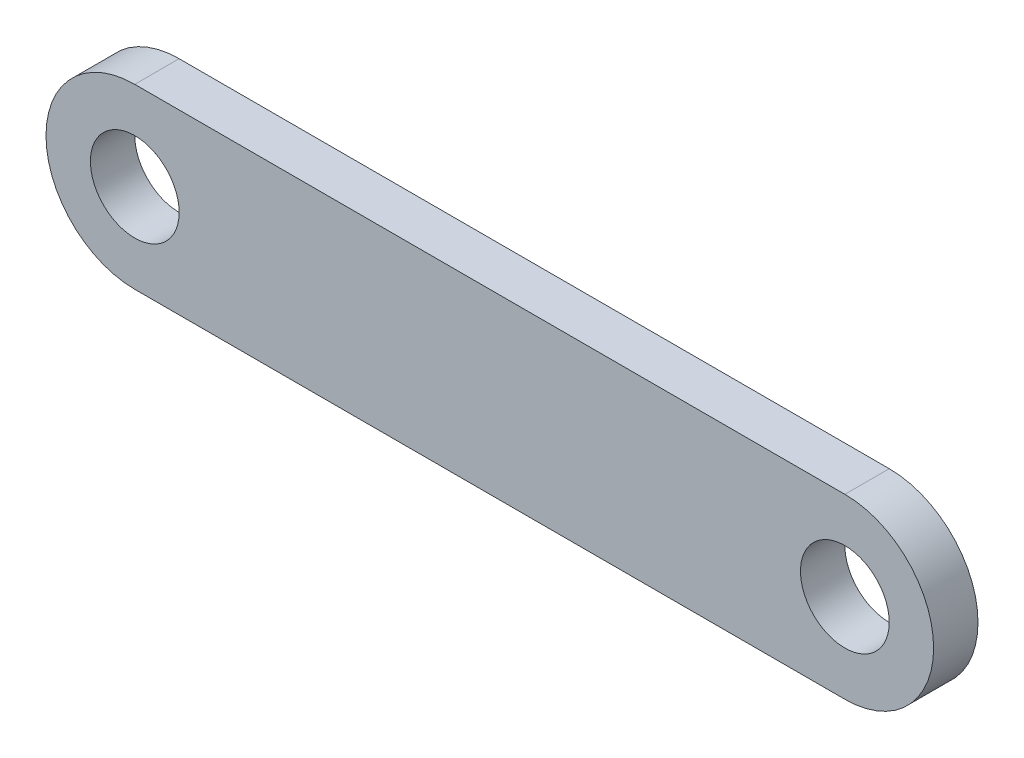
ISO-10303-21;
HEADER;
FILE_DESCRIPTION(('STEP AP214'),'2;1');
FILE_NAME('part.step','',(''),(''),'','','');
FILE_SCHEMA(('AUTOMOTIVE_DESIGN { 1 0 10303 214 1 1 1 1 }'));
ENDSEC;
DATA;
#1=APPLICATION_CONTEXT('core data for automotive mechanical design processes');
#2=APPLICATION_PROTOCOL_DEFINITION('international standard','automotive_design',2000,#1);
#3=PRODUCT_CONTEXT('',#1,'mechanical');
#4=PRODUCT('Part','Part','',(#3));
#5=PRODUCT_RELATED_PRODUCT_CATEGORY('part','',(#4));
#6=PRODUCT_DEFINITION_FORMATION('','',#4);
#7=PRODUCT_DEFINITION_CONTEXT('part definition',#1,'design');
#8=PRODUCT_DEFINITION('design','',#6,#7);
#9=PRODUCT_DEFINITION_SHAPE('','',#8);
#10=(LENGTH_UNIT() NAMED_UNIT(*) SI_UNIT(.MILLI.,.METRE.));
#11=(NAMED_UNIT(*) PLANE_ANGLE_UNIT() SI_UNIT($,.RADIAN.));
#12=(NAMED_UNIT(*) SI_UNIT($,.STERADIAN.) SOLID_ANGLE_UNIT());
#13=UNCERTAINTY_MEASURE_WITH_UNIT(LENGTH_MEASURE(1.E-05),#10,'distance_accuracy_value','');
#14=(GEOMETRIC_REPRESENTATION_CONTEXT(3) GLOBAL_UNCERTAINTY_ASSIGNED_CONTEXT((#13)) GLOBAL_UNIT_ASSIGNED_CONTEXT((#10,
#11,#12)) REPRESENTATION_CONTEXT('',''));
#15=CARTESIAN_POINT('',(0.,0.,0.));
#16=DIRECTION('',(0.,0.,1.));
#17=DIRECTION('',(1.,0.,0.));
#18=AXIS2_PLACEMENT_3D('',#15,#16,#17);
#19=CARTESIAN_POINT('',(19.1994961062758,-0.508474576271185,1.));
#20=DIRECTION('',(0.,0.,1.));
#21=DIRECTION('',(1.,0.,0.));
#22=AXIS2_PLACEMENT_3D('',#19,#20,#21);
#23=PLANE('',#22);
#24=CARTESIAN_POINT('',(19.1994961062758,-0.508474576271185,1.));
#25=DIRECTION('',(0.,0.,1.));
#26=DIRECTION('',(1.,0.,0.));
#27=AXIS2_PLACEMENT_3D('',#24,#25,#26);
#28=CIRCLE('',#27,2.);
#29=CARTESIAN_POINT('',(21.1994961062758,-0.508474576271185,1.));
#30=VERTEX_POINT('',#29);
#31=EDGE_CURVE('E100',#30,#30,#28,.T.);
#32=ORIENTED_EDGE('',*,*,#31,.F.);
#33=EDGE_LOOP('',(#32));
#34=FACE_BOUND('',#33,.T.);
#35=CARTESIAN_POINT('',(19.1994961062758,-0.508474576271185,1.));
#36=DIRECTION('',(0.,0.,1.));
#37=DIRECTION('',(1.,0.,0.));
#38=AXIS2_PLACEMENT_3D('',#35,#36,#37);
#39=CIRCLE('',#38,4.);
#40=CARTESIAN_POINT('',(19.1994961062758,-4.50847457627119,1.));
#41=VERTEX_POINT('',#40);
#42=CARTESIAN_POINT('',(19.1994961062758,3.49152542372882,1.));
#43=VERTEX_POINT('',#42);
#44=EDGE_CURVE('E85',#41,#43,#39,.T.);
#45=ORIENTED_EDGE('',*,*,#44,.T.);
#46=DIRECTION('',(-1.,0.,0.));
#47=VECTOR('',#46,1.);
#48=CARTESIAN_POINT('',(19.1994961062758,3.49152542372882,1.));
#49=LINE('',#48,#47);
#50=CARTESIAN_POINT('',(-12.8005038937242,3.49152542372881,1.));
#51=VERTEX_POINT('',#50);
#52=EDGE_CURVE('E80',#43,#51,#49,.T.);
#53=ORIENTED_EDGE('',*,*,#52,.T.);
#54=CARTESIAN_POINT('',(-12.8005038937242,-0.508474576271187,1.));
#55=DIRECTION('',(0.,0.,1.));
#56=DIRECTION('',(1.,0.,0.));
#57=AXIS2_PLACEMENT_3D('',#54,#55,#56);
#58=CIRCLE('',#57,4.);
#59=CARTESIAN_POINT('',(-12.8005038937242,-4.50847457627119,1.));
#60=VERTEX_POINT('',#59);
#61=EDGE_CURVE('E83',#51,#60,#58,.T.);
#62=ORIENTED_EDGE('',*,*,#61,.T.);
#63=DIRECTION('',(1.,0.,0.));
#64=VECTOR('',#63,1.);
#65=CARTESIAN_POINT('',(19.1994961062758,-4.50847457627119,1.));
#66=LINE('',#65,#64);
#67=EDGE_CURVE('E50',#60,#41,#66,.T.);
#68=ORIENTED_EDGE('',*,*,#67,.T.);
#69=EDGE_LOOP('',(#45,#53,#62,#68));
#70=FACE_BOUND('',#69,.T.);
#71=CARTESIAN_POINT('',(-12.8005038937242,-0.508474576271187,1.));
#72=DIRECTION('',(0.,0.,1.));
#73=DIRECTION('',(1.,0.,0.));
#74=AXIS2_PLACEMENT_3D('',#71,#72,#73);
#75=CIRCLE('',#74,2.);
#76=CARTESIAN_POINT('',(-10.8005038937242,-0.508474576271187,1.));
#77=VERTEX_POINT('',#76);
#78=EDGE_CURVE('E115',#77,#77,#75,.T.);
#79=ORIENTED_EDGE('',*,*,#78,.F.);
#80=EDGE_LOOP('',(#79));
#81=FACE_BOUND('',#80,.T.);
#82=ADVANCED_FACE('F33',(#34,#70,#81),#23,.T.);
#83=CARTESIAN_POINT('',(19.1994961062758,-0.508474576271185,-1.));
#84=DIRECTION('',(0.,0.,1.));
#85=DIRECTION('',(1.,0.,0.));
#86=AXIS2_PLACEMENT_3D('',#83,#84,#85);
#87=PLANE('',#86);
#88=CARTESIAN_POINT('',(19.1994961062758,-0.508474576271185,-1.));
#89=DIRECTION('',(0.,0.,1.));
#90=DIRECTION('',(1.,0.,0.));
#91=AXIS2_PLACEMENT_3D('',#88,#89,#90);
#92=CIRCLE('',#91,4.);
#93=CARTESIAN_POINT('',(19.1994961062758,-4.50847457627119,-1.));
#94=VERTEX_POINT('',#93);
#95=CARTESIAN_POINT('',(19.1994961062758,3.49152542372882,-1.));
#96=VERTEX_POINT('',#95);
#97=EDGE_CURVE('E97',#94,#96,#92,.T.);
#98=ORIENTED_EDGE('',*,*,#97,.F.);
#99=DIRECTION('',(1.,0.,0.));
#100=VECTOR('',#99,1.);
#101=CARTESIAN_POINT('',(19.1994961062758,-4.50847457627119,-1.));
#102=LINE('',#101,#100);
#103=CARTESIAN_POINT('',(-12.8005038937242,-4.50847457627119,-1.));
#104=VERTEX_POINT('',#103);
#105=EDGE_CURVE('E73',#104,#94,#102,.T.);
#106=ORIENTED_EDGE('',*,*,#105,.F.);
#107=CARTESIAN_POINT('',(-12.8005038937242,-0.508474576271187,-1.));
#108=DIRECTION('',(0.,0.,1.));
#109=DIRECTION('',(1.,0.,0.));
#110=AXIS2_PLACEMENT_3D('',#107,#108,#109);
#111=CIRCLE('',#110,4.);
#112=CARTESIAN_POINT('',(-12.8005038937242,3.49152542372881,-1.));
#113=VERTEX_POINT('',#112);
#114=EDGE_CURVE('E67',#113,#104,#111,.T.);
#115=ORIENTED_EDGE('',*,*,#114,.F.);
#116=DIRECTION('',(-1.,0.,0.));
#117=VECTOR('',#116,1.);
#118=CARTESIAN_POINT('',(19.1994961062758,3.49152542372882,-1.));
#119=LINE('',#118,#117);
#120=EDGE_CURVE('E89',#96,#113,#119,.T.);
#121=ORIENTED_EDGE('',*,*,#120,.F.);
#122=EDGE_LOOP('',(#98,#106,#115,#121));
#123=FACE_BOUND('',#122,.T.);
#124=CARTESIAN_POINT('',(19.1994961062758,-0.508474576271185,-1.));
#125=DIRECTION('',(0.,0.,1.));
#126=DIRECTION('',(1.,0.,0.));
#127=AXIS2_PLACEMENT_3D('',#124,#125,#126);
#128=CIRCLE('',#127,2.);
#129=CARTESIAN_POINT('',(21.1994961062758,-0.508474576271185,-1.));
#130=VERTEX_POINT('',#129);
#131=EDGE_CURVE('E112',#130,#130,#128,.T.);
#132=ORIENTED_EDGE('',*,*,#131,.T.);
#133=EDGE_LOOP('',(#132));
#134=FACE_BOUND('',#133,.T.);
#135=CARTESIAN_POINT('',(-12.8005038937242,-0.508474576271187,-1.));
#136=DIRECTION('',(0.,0.,1.));
#137=DIRECTION('',(1.,0.,0.));
#138=AXIS2_PLACEMENT_3D('',#135,#136,#137);
#139=CIRCLE('',#138,2.);
#140=CARTESIAN_POINT('',(-10.8005038937242,-0.508474576271187,-1.));
#141=VERTEX_POINT('',#140);
#142=EDGE_CURVE('E118',#141,#141,#139,.T.);
#143=ORIENTED_EDGE('',*,*,#142,.T.);
#144=EDGE_LOOP('',(#143));
#145=FACE_BOUND('',#144,.T.);
#146=ADVANCED_FACE('F108',(#123,#134,#145),#87,.F.);
#147=CARTESIAN_POINT('',(19.1994961062758,-0.508474576271185,1.));
#148=DIRECTION('',(0.,0.,-1.));
#149=DIRECTION('',(-1.,0.,0.));
#150=AXIS2_PLACEMENT_3D('',#147,#148,#149);
#151=CYLINDRICAL_SURFACE('',#150,4.);
#152=ORIENTED_EDGE('',*,*,#97,.T.);
#153=DIRECTION('',(0.,0.,-1.));
#154=VECTOR('',#153,1.);
#155=CARTESIAN_POINT('',(19.1994961062758,3.49152542372882,1.));
#156=LINE('',#155,#154);
#157=EDGE_CURVE('E11',#43,#96,#156,.T.);
#158=ORIENTED_EDGE('',*,*,#157,.F.);
#159=ORIENTED_EDGE('',*,*,#44,.F.);
#160=DIRECTION('',(0.,0.,-1.));
#161=VECTOR('',#160,1.);
#162=CARTESIAN_POINT('',(19.1994961062758,-4.50847457627119,1.));
#163=LINE('',#162,#161);
#164=EDGE_CURVE('E93',#41,#94,#163,.T.);
#165=ORIENTED_EDGE('',*,*,#164,.T.);
#166=EDGE_LOOP('',(#152,#158,#159,#165));
#167=FACE_BOUND('',#166,.T.);
#168=ADVANCED_FACE('F35',(#167),#151,.T.);
#169=CARTESIAN_POINT('',(19.1994961062758,3.49152542372882,1.));
#170=DIRECTION('',(0.,-1.,0.));
#171=DIRECTION('',(1.,0.,0.));
#172=AXIS2_PLACEMENT_3D('',#169,#170,#171);
#173=PLANE('',#172);
#174=ORIENTED_EDGE('',*,*,#120,.T.);
#175=DIRECTION('',(0.,0.,-1.));
#176=VECTOR('',#175,1.);
#177=CARTESIAN_POINT('',(-12.8005038937242,3.49152542372881,1.));
#178=LINE('',#177,#176);
#179=EDGE_CURVE('E42',#51,#113,#178,.T.);
#180=ORIENTED_EDGE('',*,*,#179,.F.);
#181=ORIENTED_EDGE('',*,*,#52,.F.);
#182=ORIENTED_EDGE('',*,*,#157,.T.);
#183=EDGE_LOOP('',(#174,#180,#181,#182));
#184=FACE_BOUND('',#183,.T.);
#185=ADVANCED_FACE('F88',(#184),#173,.F.);
#186=CARTESIAN_POINT('',(-12.8005038937242,-0.508474576271187,1.));
#187=DIRECTION('',(0.,0.,-1.));
#188=DIRECTION('',(-1.,0.,0.));
#189=AXIS2_PLACEMENT_3D('',#186,#187,#188);
#190=CYLINDRICAL_SURFACE('',#189,4.);
#191=ORIENTED_EDGE('',*,*,#114,.T.);
#192=DIRECTION('',(0.,0.,-1.));
#193=VECTOR('',#192,1.);
#194=CARTESIAN_POINT('',(-12.8005038937242,-4.50847457627119,1.));
#195=LINE('',#194,#193);
#196=EDGE_CURVE('E90',#60,#104,#195,.T.);
#197=ORIENTED_EDGE('',*,*,#196,.F.);
#198=ORIENTED_EDGE('',*,*,#61,.F.);
#199=ORIENTED_EDGE('',*,*,#179,.T.);
#200=EDGE_LOOP('',(#191,#197,#198,#199));
#201=FACE_BOUND('',#200,.T.);
#202=ADVANCED_FACE('F91',(#201),#190,.T.);
#203=CARTESIAN_POINT('',(19.1994961062758,-4.50847457627119,1.));
#204=DIRECTION('',(0.,1.,0.));
#205=DIRECTION('',(-1.,0.,0.));
#206=AXIS2_PLACEMENT_3D('',#203,#204,#205);
#207=PLANE('',#206);
#208=ORIENTED_EDGE('',*,*,#105,.T.);
#209=ORIENTED_EDGE('',*,*,#164,.F.);
#210=ORIENTED_EDGE('',*,*,#67,.F.);
#211=ORIENTED_EDGE('',*,*,#196,.T.);
#212=EDGE_LOOP('',(#208,#209,#210,#211));
#213=FACE_BOUND('',#212,.T.);
#214=ADVANCED_FACE('F105',(#213),#207,.F.);
#215=CARTESIAN_POINT('',(19.1994961062758,-0.508474576271185,1.));
#216=DIRECTION('',(0.,0.,-1.));
#217=DIRECTION('',(-1.,0.,0.));
#218=AXIS2_PLACEMENT_3D('',#215,#216,#217);
#219=CYLINDRICAL_SURFACE('',#218,2.);
#220=ORIENTED_EDGE('',*,*,#31,.T.);
#221=EDGE_LOOP('',(#220));
#222=FACE_BOUND('',#221,.T.);
#223=ORIENTED_EDGE('',*,*,#131,.F.);
#224=EDGE_LOOP('',(#223));
#225=FACE_BOUND('',#224,.T.);
#226=ADVANCED_FACE('F135',(#222,#225),#219,.F.);
#227=CARTESIAN_POINT('',(-12.8005038937242,-0.508474576271187,1.));
#228=DIRECTION('',(0.,0.,-1.));
#229=DIRECTION('',(-1.,0.,0.));
#230=AXIS2_PLACEMENT_3D('',#227,#228,#229);
#231=CYLINDRICAL_SURFACE('',#230,2.);
#232=ORIENTED_EDGE('',*,*,#78,.T.);
#233=EDGE_LOOP('',(#232));
#234=FACE_BOUND('',#233,.T.);
#235=ORIENTED_EDGE('',*,*,#142,.F.);
#236=EDGE_LOOP('',(#235));
#237=FACE_BOUND('',#236,.T.);
#238=ADVANCED_FACE('F124',(#234,#237),#231,.F.);
#239=CLOSED_SHELL('',(#82,#146,#168,#185,#202,#214,#226,#238));
#240=MANIFOLD_SOLID_BREP('B2',#239);
#241=ADVANCED_BREP_SHAPE_REPRESENTATION('',(#18,#240),#14);
#242=SHAPE_DEFINITION_REPRESENTATION(#9,#241);
ENDSEC;
END-ISO-10303-21;
